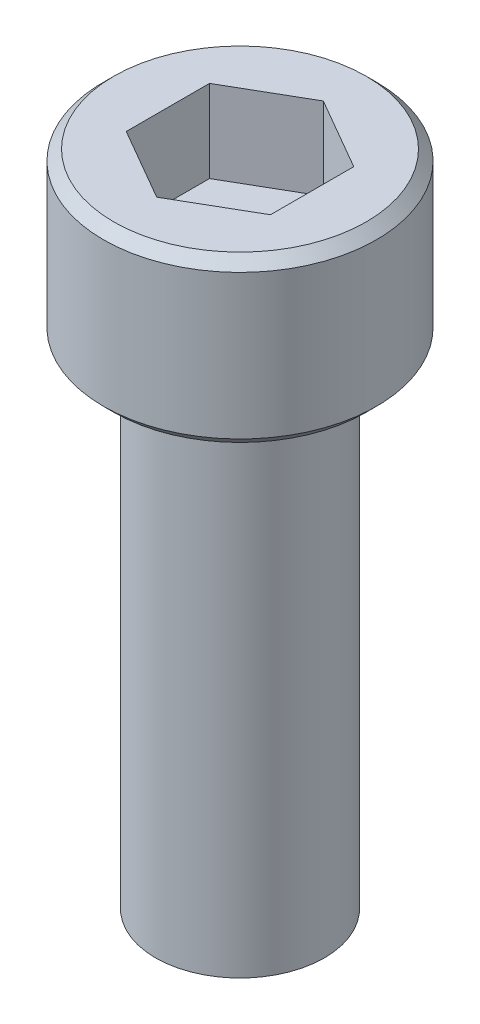
ISO-10303-21;
HEADER;
FILE_DESCRIPTION(('STEP AP214'),'2;1');
FILE_NAME('part.step','',(''),(''),'','','');
FILE_SCHEMA(('AUTOMOTIVE_DESIGN { 1 0 10303 214 1 1 1 1 }'));
ENDSEC;
DATA;
#1=APPLICATION_CONTEXT('core data for automotive mechanical design processes');
#2=APPLICATION_PROTOCOL_DEFINITION('international standard','automotive_design',2000,#1);
#3=PRODUCT_CONTEXT('',#1,'mechanical');
#4=PRODUCT('Part','Part','',(#3));
#5=PRODUCT_RELATED_PRODUCT_CATEGORY('part','',(#4));
#6=PRODUCT_DEFINITION_FORMATION('','',#4);
#7=PRODUCT_DEFINITION_CONTEXT('part definition',#1,'design');
#8=PRODUCT_DEFINITION('design','',#6,#7);
#9=PRODUCT_DEFINITION_SHAPE('','',#8);
#10=(LENGTH_UNIT() NAMED_UNIT(*) SI_UNIT(.MILLI.,.METRE.));
#11=(NAMED_UNIT(*) PLANE_ANGLE_UNIT() SI_UNIT($,.RADIAN.));
#12=(NAMED_UNIT(*) SI_UNIT($,.STERADIAN.) SOLID_ANGLE_UNIT());
#13=UNCERTAINTY_MEASURE_WITH_UNIT(LENGTH_MEASURE(1.E-05),#10,'distance_accuracy_value','');
#14=(GEOMETRIC_REPRESENTATION_CONTEXT(3) GLOBAL_UNCERTAINTY_ASSIGNED_CONTEXT((#13)) GLOBAL_UNIT_ASSIGNED_CONTEXT((#10,
#11,#12)) REPRESENTATION_CONTEXT('',''));
#15=CARTESIAN_POINT('',(0.,0.,0.));
#16=DIRECTION('',(0.,0.,1.));
#17=DIRECTION('',(1.,0.,0.));
#18=AXIS2_PLACEMENT_3D('',#15,#16,#17);
#19=CARTESIAN_POINT('',(1.778,2.03200000000001,3.07958633585744));
#20=DIRECTION('',(0.,1.,0.));
#21=DIRECTION('',(0.,0.,1.));
#22=AXIS2_PLACEMENT_3D('',#19,#20,#21);
#23=PLANE('',#22);
#24=DIRECTION('',(-0.866025403784439,0.,0.5));
#25=VECTOR('',#24,1.);
#26=CARTESIAN_POINT('',(0.,2.03200000000001,-2.05305755723829));
#27=LINE('',#26,#25);
#28=CARTESIAN_POINT('',(0.,2.03200000000001,-2.0530575572383));
#29=VERTEX_POINT('',#28);
#30=CARTESIAN_POINT('',(-1.778,2.03200000000001,-1.02652877861915));
#31=VERTEX_POINT('',#30);
#32=EDGE_CURVE('E68',#29,#31,#27,.T.);
#33=ORIENTED_EDGE('',*,*,#32,.T.);
#34=DIRECTION('',(0.,0.,1.));
#35=VECTOR('',#34,1.);
#36=CARTESIAN_POINT('',(-1.778,2.03200000000001,-1.02652877861915));
#37=LINE('',#36,#35);
#38=CARTESIAN_POINT('',(-1.778,2.03200000000001,1.02652877861915));
#39=VERTEX_POINT('',#38);
#40=EDGE_CURVE('E70',#31,#39,#37,.T.);
#41=ORIENTED_EDGE('',*,*,#40,.T.);
#42=DIRECTION('',(0.866025403784439,0.,0.499999999999999));
#43=VECTOR('',#42,1.);
#44=CARTESIAN_POINT('',(-1.77800000000001,2.03200000000001,1.02652877861915));
#45=LINE('',#44,#43);
#46=CARTESIAN_POINT('',(0.,2.03200000000001,2.05305755723831));
#47=VERTEX_POINT('',#46);
#48=EDGE_CURVE('E72',#39,#47,#45,.T.);
#49=ORIENTED_EDGE('',*,*,#48,.T.);
#50=DIRECTION('',(0.866025403784439,0.,-0.5));
#51=VECTOR('',#50,1.);
#52=CARTESIAN_POINT('',(0.,2.03200000000001,2.05305755723831));
#53=LINE('',#52,#51);
#54=CARTESIAN_POINT('',(1.77799999999999,2.03200000000001,1.02652877861915));
#55=VERTEX_POINT('',#54);
#56=EDGE_CURVE('E127',#47,#55,#53,.T.);
#57=ORIENTED_EDGE('',*,*,#56,.T.);
#58=DIRECTION('',(0.,0.,-1.));
#59=VECTOR('',#58,1.);
#60=CARTESIAN_POINT('',(1.77799999999999,2.03200000000001,1.02652877861915));
#61=LINE('',#60,#59);
#62=CARTESIAN_POINT('',(1.77799999999999,2.03200000000001,-1.02652877861916));
#63=VERTEX_POINT('',#62);
#64=EDGE_CURVE('E132',#55,#63,#61,.T.);
#65=ORIENTED_EDGE('',*,*,#64,.T.);
#66=DIRECTION('',(-0.866025403784439,0.,-0.5));
#67=VECTOR('',#66,1.);
#68=CARTESIAN_POINT('',(1.77799999999999,2.03200000000001,-1.02652877861916));
#69=LINE('',#68,#67);
#70=EDGE_CURVE('E136',#63,#29,#69,.T.);
#71=ORIENTED_EDGE('',*,*,#70,.T.);
#72=EDGE_LOOP('',(#33,#41,#49,#57,#65,#71));
#73=FACE_BOUND('',#72,.T.);
#74=ADVANCED_FACE('F17',(#73),#23,.T.);
#75=CARTESIAN_POINT('',(-1.77800000000001,2.03200000000001,1.02652877861915));
#76=DIRECTION('',(-0.499999999999999,0.,0.866025403784439));
#77=DIRECTION('',(0.866025403784439,0.,0.499999999999999));
#78=AXIS2_PLACEMENT_3D('',#75,#76,#77);
#79=PLANE('',#78);
#80=DIRECTION('',(0.,1.,0.));
#81=VECTOR('',#80,1.);
#82=CARTESIAN_POINT('',(0.,2.03200000000001,2.05305755723831));
#83=LINE('',#82,#81);
#84=CARTESIAN_POINT('',(0.,4.06400000000001,2.05305755723831));
#85=VERTEX_POINT('',#84);
#86=EDGE_CURVE('E83',#85,#47,#83,.F.);
#87=ORIENTED_EDGE('',*,*,#86,.T.);
#88=ORIENTED_EDGE('',*,*,#48,.F.);
#89=DIRECTION('',(0.,1.,0.));
#90=VECTOR('',#89,1.);
#91=CARTESIAN_POINT('',(-1.778,2.03200000000001,1.02652877861915));
#92=LINE('',#91,#90);
#93=CARTESIAN_POINT('',(-1.778,4.06400000000001,1.02652877861915));
#94=VERTEX_POINT('',#93);
#95=EDGE_CURVE('E77',#39,#94,#92,.T.);
#96=ORIENTED_EDGE('',*,*,#95,.T.);
#97=DIRECTION('',(-0.866025403784438,0.,-0.500000000000001));
#98=VECTOR('',#97,1.);
#99=CARTESIAN_POINT('',(0.,4.06400000000001,2.05305755723831));
#100=LINE('',#99,#98);
#101=EDGE_CURVE('E124',#85,#94,#100,.T.);
#102=ORIENTED_EDGE('',*,*,#101,.F.);
#103=EDGE_LOOP('',(#87,#88,#96,#102));
#104=FACE_BOUND('',#103,.T.);
#105=ADVANCED_FACE('F80',(#104),#79,.F.);
#106=CARTESIAN_POINT('',(-1.778,2.03200000000001,-1.02652877861915));
#107=DIRECTION('',(-1.,0.,0.));
#108=DIRECTION('',(0.,0.,1.));
#109=AXIS2_PLACEMENT_3D('',#106,#107,#108);
#110=PLANE('',#109);
#111=ORIENTED_EDGE('',*,*,#95,.F.);
#112=ORIENTED_EDGE('',*,*,#40,.F.);
#113=DIRECTION('',(0.,1.,0.));
#114=VECTOR('',#113,1.);
#115=CARTESIAN_POINT('',(-1.778,2.03200000000001,-1.02652877861914));
#116=LINE('',#115,#114);
#117=CARTESIAN_POINT('',(-1.778,4.06400000000001,-1.02652877861915));
#118=VERTEX_POINT('',#117);
#119=EDGE_CURVE('E91',#31,#118,#116,.T.);
#120=ORIENTED_EDGE('',*,*,#119,.T.);
#121=DIRECTION('',(0.,0.,1.));
#122=VECTOR('',#121,1.);
#123=CARTESIAN_POINT('',(-1.77800000000001,4.06400000000001,0.));
#124=LINE('',#123,#122);
#125=EDGE_CURVE('E88',#94,#118,#124,.F.);
#126=ORIENTED_EDGE('',*,*,#125,.F.);
#127=EDGE_LOOP('',(#111,#112,#120,#126));
#128=FACE_BOUND('',#127,.T.);
#129=ADVANCED_FACE('F86',(#128),#110,.F.);
#130=CARTESIAN_POINT('',(0.,2.03200000000001,-2.05305755723829));
#131=DIRECTION('',(-0.5,0.,-0.866025403784439));
#132=DIRECTION('',(-0.866025403784439,0.,0.5));
#133=AXIS2_PLACEMENT_3D('',#130,#131,#132);
#134=PLANE('',#133);
#135=ORIENTED_EDGE('',*,*,#119,.F.);
#136=ORIENTED_EDGE('',*,*,#32,.F.);
#137=DIRECTION('',(0.,1.,0.));
#138=VECTOR('',#137,1.);
#139=CARTESIAN_POINT('',(0.,2.03200000000001,-2.05305755723831));
#140=LINE('',#139,#138);
#141=CARTESIAN_POINT('',(0.,4.06400000000001,-2.0530575572383));
#142=VERTEX_POINT('',#141);
#143=EDGE_CURVE('E134',#29,#142,#140,.T.);
#144=ORIENTED_EDGE('',*,*,#143,.T.);
#145=DIRECTION('',(0.86602540378444,0.,-0.499999999999998));
#146=VECTOR('',#145,1.);
#147=CARTESIAN_POINT('',(-1.778,4.06400000000001,-1.02652877861915));
#148=LINE('',#147,#146);
#149=EDGE_CURVE('E120',#118,#142,#148,.T.);
#150=ORIENTED_EDGE('',*,*,#149,.F.);
#151=EDGE_LOOP('',(#135,#136,#144,#150));
#152=FACE_BOUND('',#151,.T.);
#153=ADVANCED_FACE('F139',(#152),#134,.F.);
#154=CARTESIAN_POINT('',(1.77799999999999,2.03200000000001,-1.02652877861916));
#155=DIRECTION('',(0.5,0.,-0.866025403784439));
#156=DIRECTION('',(-0.866025403784439,0.,-0.5));
#157=AXIS2_PLACEMENT_3D('',#154,#155,#156);
#158=PLANE('',#157);
#159=ORIENTED_EDGE('',*,*,#143,.F.);
#160=ORIENTED_EDGE('',*,*,#70,.F.);
#161=DIRECTION('',(0.,1.,0.));
#162=VECTOR('',#161,1.);
#163=CARTESIAN_POINT('',(1.77799999999999,2.03200000000001,-1.02652877861916));
#164=LINE('',#163,#162);
#165=CARTESIAN_POINT('',(1.77799999999999,4.06400000000001,-1.02652877861916));
#166=VERTEX_POINT('',#165);
#167=EDGE_CURVE('E130',#63,#166,#164,.T.);
#168=ORIENTED_EDGE('',*,*,#167,.T.);
#169=DIRECTION('',(0.866025403784443,0.,0.499999999999992));
#170=VECTOR('',#169,1.);
#171=CARTESIAN_POINT('',(0.,4.06400000000001,-2.05305755723829));
#172=LINE('',#171,#170);
#173=EDGE_CURVE('E117',#142,#166,#172,.T.);
#174=ORIENTED_EDGE('',*,*,#173,.F.);
#175=EDGE_LOOP('',(#159,#160,#168,#174));
#176=FACE_BOUND('',#175,.T.);
#177=ADVANCED_FACE('F151',(#176),#158,.F.);
#178=CARTESIAN_POINT('',(1.77799999999999,2.03200000000001,1.02652877861915));
#179=DIRECTION('',(1.,0.,0.));
#180=DIRECTION('',(0.,0.,-1.));
#181=AXIS2_PLACEMENT_3D('',#178,#179,#180);
#182=PLANE('',#181);
#183=ORIENTED_EDGE('',*,*,#167,.F.);
#184=ORIENTED_EDGE('',*,*,#64,.F.);
#185=DIRECTION('',(0.,1.,0.));
#186=VECTOR('',#185,1.);
#187=CARTESIAN_POINT('',(1.77799999999999,2.03200000000001,1.02652877861915));
#188=LINE('',#187,#186);
#189=CARTESIAN_POINT('',(1.77799999999999,4.06400000000001,1.02652877861915));
#190=VERTEX_POINT('',#189);
#191=EDGE_CURVE('E35',#55,#190,#188,.T.);
#192=ORIENTED_EDGE('',*,*,#191,.T.);
#193=DIRECTION('',(0.,0.,1.));
#194=VECTOR('',#193,1.);
#195=CARTESIAN_POINT('',(1.77799999999999,4.06400000000001,0.));
#196=LINE('',#195,#194);
#197=EDGE_CURVE('E114',#166,#190,#196,.T.);
#198=ORIENTED_EDGE('',*,*,#197,.F.);
#199=EDGE_LOOP('',(#183,#184,#192,#198));
#200=FACE_BOUND('',#199,.T.);
#201=ADVANCED_FACE('F149',(#200),#182,.F.);
#202=CARTESIAN_POINT('',(0.,2.03200000000001,2.05305755723831));
#203=DIRECTION('',(0.5,0.,0.866025403784439));
#204=DIRECTION('',(0.866025403784439,0.,-0.5));
#205=AXIS2_PLACEMENT_3D('',#202,#203,#204);
#206=PLANE('',#205);
#207=ORIENTED_EDGE('',*,*,#191,.F.);
#208=ORIENTED_EDGE('',*,*,#56,.F.);
#209=ORIENTED_EDGE('',*,*,#86,.F.);
#210=DIRECTION('',(-0.866025403784439,0.,0.499999999999999));
#211=VECTOR('',#210,1.);
#212=CARTESIAN_POINT('',(1.77799999999999,4.06400000000001,1.02652877861915));
#213=LINE('',#212,#211);
#214=EDGE_CURVE('E111',#190,#85,#213,.T.);
#215=ORIENTED_EDGE('',*,*,#214,.F.);
#216=EDGE_LOOP('',(#207,#208,#209,#215));
#217=FACE_BOUND('',#216,.T.);
#218=ADVANCED_FACE('F146',(#217),#206,.F.);
#219=CARTESIAN_POINT('',(0.,4.06400000000001,0.));
#220=DIRECTION('',(0.,1.,0.));
#221=DIRECTION('',(0.,0.,1.));
#222=AXIS2_PLACEMENT_3D('',#219,#220,#221);
#223=PLANE('',#222);
#224=ORIENTED_EDGE('',*,*,#197,.T.);
#225=ORIENTED_EDGE('',*,*,#214,.T.);
#226=ORIENTED_EDGE('',*,*,#101,.T.);
#227=ORIENTED_EDGE('',*,*,#125,.T.);
#228=ORIENTED_EDGE('',*,*,#149,.T.);
#229=ORIENTED_EDGE('',*,*,#173,.T.);
#230=EDGE_LOOP('',(#224,#225,#226,#227,#228,#229));
#231=FACE_BOUND('',#230,.T.);
#232=CARTESIAN_POINT('',(0.,4.06400000002805,0.));
#233=DIRECTION('',(0.,-1.,0.));
#234=DIRECTION('',(0.,0.,-1.));
#235=AXIS2_PLACEMENT_3D('',#232,#233,#234);
#236=CIRCLE('',#235,3.11150000004545);
#237=CARTESIAN_POINT('',(0.,4.06400000002805,-3.11150000004545));
#238=VERTEX_POINT('',#237);
#239=EDGE_CURVE('E20',#238,#238,#236,.T.);
#240=ORIENTED_EDGE('',*,*,#239,.F.);
#241=EDGE_LOOP('',(#240));
#242=FACE_BOUND('',#241,.T.);
#243=ADVANCED_FACE('F143',(#231,#242),#223,.T.);
#244=CARTESIAN_POINT('',(0.,3.80999999998721,0.));
#245=DIRECTION('',(0.,-1.,0.));
#246=DIRECTION('',(0.,0.,-1.));
#247=AXIS2_PLACEMENT_3D('',#244,#245,#246);
#248=CONICAL_SURFACE('',#247,3.36550000002944,0.785398163285552);
#249=ORIENTED_EDGE('',*,*,#239,.T.);
#250=EDGE_LOOP('',(#249));
#251=FACE_BOUND('',#250,.T.);
#252=CARTESIAN_POINT('',(0.,3.81000000000001,0.));
#253=DIRECTION('',(0.,-1.,0.));
#254=DIRECTION('',(0.,0.,-1.));
#255=AXIS2_PLACEMENT_3D('',#252,#253,#254);
#256=CIRCLE('',#255,3.3655);
#257=CARTESIAN_POINT('',(0.,3.81000000000001,-3.3655));
#258=VERTEX_POINT('',#257);
#259=EDGE_CURVE('E103',#258,#258,#256,.T.);
#260=ORIENTED_EDGE('',*,*,#259,.F.);
#261=EDGE_LOOP('',(#260));
#262=FACE_BOUND('',#261,.T.);
#263=ADVANCED_FACE('F188',(#251,#262),#248,.T.);
#264=CARTESIAN_POINT('',(0.,4.06400000000001,0.));
#265=DIRECTION('',(0.,-1.,0.));
#266=DIRECTION('',(0.,0.,-1.));
#267=AXIS2_PLACEMENT_3D('',#264,#265,#266);
#268=CYLINDRICAL_SURFACE('',#267,3.3655);
#269=ORIENTED_EDGE('',*,*,#259,.T.);
#270=EDGE_LOOP('',(#269));
#271=FACE_BOUND('',#270,.T.);
#272=CARTESIAN_POINT('',(0.,0.253999999983989,0.));
#273=DIRECTION('',(0.,1.,0.));
#274=DIRECTION('',(0.,0.,1.));
#275=AXIS2_PLACEMENT_3D('',#272,#273,#274);
#276=CIRCLE('',#275,3.3654999999726);
#277=CARTESIAN_POINT('',(0.,0.253999999983989,3.3654999999726));
#278=VERTEX_POINT('',#277);
#279=EDGE_CURVE('E99',#278,#278,#276,.F.);
#280=ORIENTED_EDGE('',*,*,#279,.F.);
#281=EDGE_LOOP('',(#280));
#282=FACE_BOUND('',#281,.T.);
#283=ADVANCED_FACE('F184',(#271,#282),#268,.T.);
#284=CARTESIAN_POINT('',(0.,-12.7,0.));
#285=DIRECTION('',(0.,1.,0.));
#286=DIRECTION('',(0.,0.,1.));
#287=AXIS2_PLACEMENT_3D('',#284,#285,#286);
#288=PLANE('',#287);
#289=CARTESIAN_POINT('',(0.,-12.6999999999953,0.));
#290=DIRECTION('',(0.,1.,0.));
#291=DIRECTION('',(-1.,0.,0.));
#292=AXIS2_PLACEMENT_3D('',#289,#290,#291);
#293=CIRCLE('',#292,1.31318000006786);
#294=CARTESIAN_POINT('',(-1.31318000006786,-12.6999999999953,0.));
#295=VERTEX_POINT('',#294);
#296=EDGE_CURVE('E97',#295,#295,#293,.T.);
#297=ORIENTED_EDGE('',*,*,#296,.F.);
#298=EDGE_LOOP('',(#297));
#299=FACE_BOUND('',#298,.T.);
#300=ADVANCED_FACE('F180',(#299),#288,.F.);
#301=CARTESIAN_POINT('',(0.,0.253999999983989,0.));
#302=DIRECTION('',(0.,1.,0.));
#303=DIRECTION('',(0.,0.,1.));
#304=AXIS2_PLACEMENT_3D('',#301,#302,#303);
#305=CONICAL_SURFACE('',#304,3.3654999999726,0.785398163397448);
#306=CARTESIAN_POINT('',(0.,0.,0.));
#307=DIRECTION('',(0.,1.,0.));
#308=DIRECTION('',(0.,0.,1.));
#309=AXIS2_PLACEMENT_3D('',#306,#307,#308);
#310=CIRCLE('',#309,3.11149999998861);
#311=CARTESIAN_POINT('',(0.,0.,3.11149999998861));
#312=VERTEX_POINT('',#311);
#313=EDGE_CURVE('E95',#312,#312,#310,.T.);
#314=ORIENTED_EDGE('',*,*,#313,.T.);
#315=EDGE_LOOP('',(#314));
#316=FACE_BOUND('',#315,.T.);
#317=ORIENTED_EDGE('',*,*,#279,.T.);
#318=EDGE_LOOP('',(#317));
#319=FACE_BOUND('',#318,.T.);
#320=ADVANCED_FACE('F176',(#316,#319),#305,.T.);
#321=CARTESIAN_POINT('',(0.,-12.1615200000633,0.));
#322=DIRECTION('',(0.,1.,0.));
#323=DIRECTION('',(-1.,0.,0.));
#324=AXIS2_PLACEMENT_3D('',#321,#322,#323);
#325=CONICAL_SURFACE('',#324,2.0827999999824,0.960291895417683);
#326=CARTESIAN_POINT('',(0.,-12.16152,0.));
#327=DIRECTION('',(0.,1.,0.));
#328=DIRECTION('',(0.,0.,1.));
#329=AXIS2_PLACEMENT_3D('',#326,#327,#328);
#330=CIRCLE('',#329,2.0828);
#331=CARTESIAN_POINT('',(0.,-12.16152,2.0828));
#332=VERTEX_POINT('',#331);
#333=EDGE_CURVE('E26',#332,#332,#330,.T.);
#334=ORIENTED_EDGE('',*,*,#333,.F.);
#335=EDGE_LOOP('',(#334));
#336=FACE_BOUND('',#335,.T.);
#337=ORIENTED_EDGE('',*,*,#296,.T.);
#338=EDGE_LOOP('',(#337));
#339=FACE_BOUND('',#338,.T.);
#340=ADVANCED_FACE('F169',(#336,#339),#325,.T.);
#341=CARTESIAN_POINT('',(0.,0.,0.));
#342=DIRECTION('',(0.,1.,0.));
#343=DIRECTION('',(0.,0.,1.));
#344=AXIS2_PLACEMENT_3D('',#341,#342,#343);
#345=PLANE('',#344);
#346=CARTESIAN_POINT('',(0.,0.,0.));
#347=DIRECTION('',(0.,1.,0.));
#348=DIRECTION('',(0.,0.,1.));
#349=AXIS2_PLACEMENT_3D('',#346,#347,#348);
#350=CIRCLE('',#349,2.0828);
#351=CARTESIAN_POINT('',(0.,0.,2.0828));
#352=VERTEX_POINT('',#351);
#353=EDGE_CURVE('E11',#352,#352,#350,.F.);
#354=ORIENTED_EDGE('',*,*,#353,.F.);
#355=EDGE_LOOP('',(#354));
#356=FACE_BOUND('',#355,.T.);
#357=ORIENTED_EDGE('',*,*,#313,.F.);
#358=EDGE_LOOP('',(#357));
#359=FACE_BOUND('',#358,.T.);
#360=ADVANCED_FACE('F163',(#356,#359),#345,.F.);
#361=CARTESIAN_POINT('',(0.,-12.7,0.));
#362=DIRECTION('',(0.,1.,0.));
#363=DIRECTION('',(0.,0.,1.));
#364=AXIS2_PLACEMENT_3D('',#361,#362,#363);
#365=CYLINDRICAL_SURFACE('',#364,2.0828);
#366=ORIENTED_EDGE('',*,*,#353,.T.);
#367=EDGE_LOOP('',(#366));
#368=FACE_BOUND('',#367,.T.);
#369=ORIENTED_EDGE('',*,*,#333,.T.);
#370=EDGE_LOOP('',(#369));
#371=FACE_BOUND('',#370,.T.);
#372=ADVANCED_FACE('F161',(#368,#371),#365,.T.);
#373=CLOSED_SHELL('',(#74,#105,#129,#153,#177,#201,#218,#243,#263,#283,#300,#320,#340,#360,#372));
#374=MANIFOLD_SOLID_BREP('B1',#373);
#375=ADVANCED_BREP_SHAPE_REPRESENTATION('',(#18,#374),#14);
#376=SHAPE_DEFINITION_REPRESENTATION(#9,#375);
ENDSEC;
END-ISO-10303-21;
